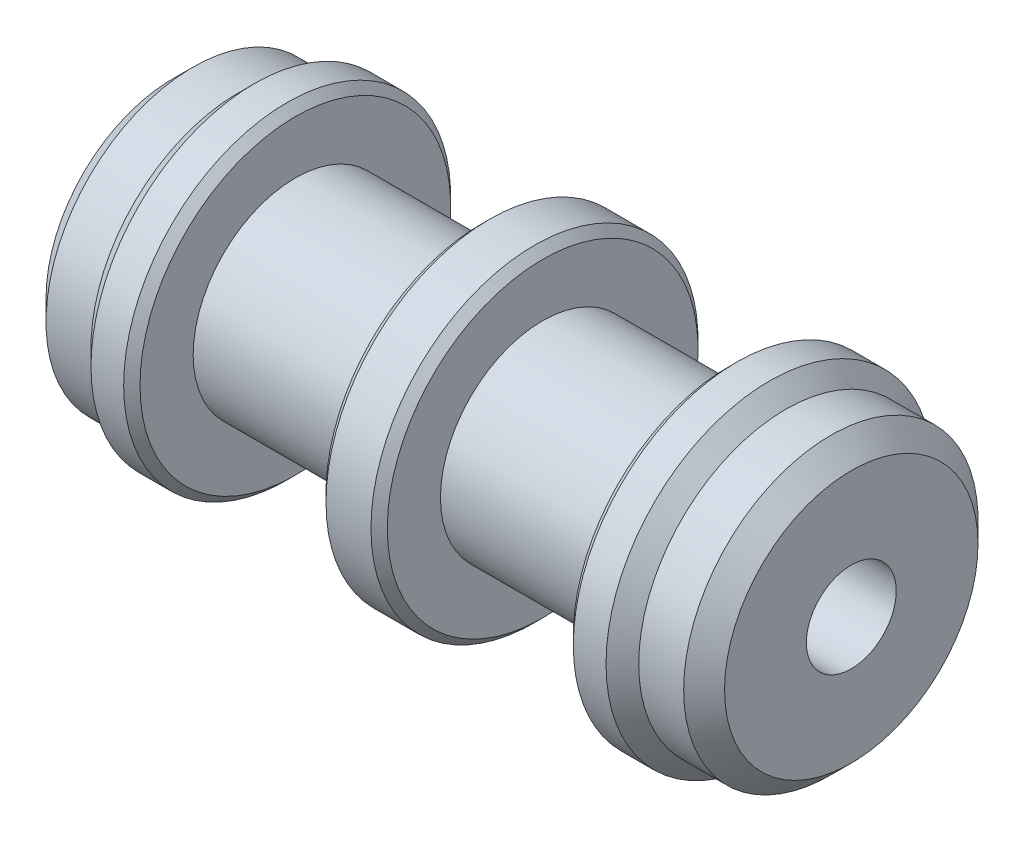
ISO-10303-21;
HEADER;
FILE_DESCRIPTION(('STEP AP214'),'2;1');
FILE_NAME('part.step','',(''),(''),'','','');
FILE_SCHEMA(('AUTOMOTIVE_DESIGN { 1 0 10303 214 1 1 1 1 }'));
ENDSEC;
DATA;
#1=APPLICATION_CONTEXT('core data for automotive mechanical design processes');
#2=APPLICATION_PROTOCOL_DEFINITION('international standard','automotive_design',2000,#1);
#3=PRODUCT_CONTEXT('',#1,'mechanical');
#4=PRODUCT('Part','Part','',(#3));
#5=PRODUCT_RELATED_PRODUCT_CATEGORY('part','',(#4));
#6=PRODUCT_DEFINITION_FORMATION('','',#4);
#7=PRODUCT_DEFINITION_CONTEXT('part definition',#1,'design');
#8=PRODUCT_DEFINITION('design','',#6,#7);
#9=PRODUCT_DEFINITION_SHAPE('','',#8);
#10=(LENGTH_UNIT() NAMED_UNIT(*) SI_UNIT(.MILLI.,.METRE.));
#11=(NAMED_UNIT(*) PLANE_ANGLE_UNIT() SI_UNIT($,.RADIAN.));
#12=(NAMED_UNIT(*) SI_UNIT($,.STERADIAN.) SOLID_ANGLE_UNIT());
#13=UNCERTAINTY_MEASURE_WITH_UNIT(LENGTH_MEASURE(1.E-05),#10,'distance_accuracy_value','');
#14=(GEOMETRIC_REPRESENTATION_CONTEXT(3) GLOBAL_UNCERTAINTY_ASSIGNED_CONTEXT((#13)) GLOBAL_UNIT_ASSIGNED_CONTEXT((#10,
#11,#12)) REPRESENTATION_CONTEXT('',''));
#15=CARTESIAN_POINT('',(0.,0.,0.));
#16=DIRECTION('',(0.,0.,1.));
#17=DIRECTION('',(1.,0.,0.));
#18=AXIS2_PLACEMENT_3D('',#15,#16,#17);
#19=CARTESIAN_POINT('',(-7.8,0.,0.));
#20=DIRECTION('',(-1.,0.,0.));
#21=DIRECTION('',(0.,0.,1.));
#22=AXIS2_PLACEMENT_3D('',#19,#20,#21);
#23=CYLINDRICAL_SURFACE('',#22,4.);
#24=CARTESIAN_POINT('',(-0.550000000032469,0.,0.));
#25=DIRECTION('',(1.,0.,0.));
#26=DIRECTION('',(0.,0.,-1.));
#27=AXIS2_PLACEMENT_3D('',#24,#25,#26);
#28=CIRCLE('',#27,3.99999999990541);
#29=CARTESIAN_POINT('',(-0.550000000032469,0.,-3.99999999990541));
#30=VERTEX_POINT('',#29);
#31=EDGE_CURVE('E62',#30,#30,#28,.F.);
#32=ORIENTED_EDGE('',*,*,#31,.F.);
#33=EDGE_LOOP('',(#32));
#34=FACE_BOUND('',#33,.T.);
#35=CARTESIAN_POINT('',(0.550000000032469,0.,0.));
#36=DIRECTION('',(-1.,0.,0.));
#37=DIRECTION('',(0.,0.,1.));
#38=AXIS2_PLACEMENT_3D('',#35,#36,#37);
#39=CIRCLE('',#38,3.99999999990541);
#40=CARTESIAN_POINT('',(0.550000000032469,0.,3.99999999990541));
#41=VERTEX_POINT('',#40);
#42=EDGE_CURVE('E30',#41,#41,#39,.F.);
#43=ORIENTED_EDGE('',*,*,#42,.F.);
#44=EDGE_LOOP('',(#43));
#45=FACE_BOUND('',#44,.T.);
#46=ADVANCED_FACE('F15',(#34,#45),#23,.T.);
#47=CARTESIAN_POINT('',(0.550000000032469,0.,0.));
#48=DIRECTION('',(-1.,0.,0.));
#49=DIRECTION('',(0.,0.,1.));
#50=AXIS2_PLACEMENT_3D('',#47,#48,#49);
#51=CONICAL_SURFACE('',#50,3.99999999990541,0.785398163397448);
#52=ORIENTED_EDGE('',*,*,#42,.T.);
#53=EDGE_LOOP('',(#52));
#54=FACE_BOUND('',#53,.T.);
#55=CARTESIAN_POINT('',(0.749999999925421,0.,0.));
#56=DIRECTION('',(-1.,0.,0.));
#57=DIRECTION('',(0.,0.,1.));
#58=AXIS2_PLACEMENT_3D('',#55,#56,#57);
#59=CIRCLE('',#58,3.80000000001246);
#60=CARTESIAN_POINT('',(0.749999999925421,0.,3.80000000001246));
#61=VERTEX_POINT('',#60);
#62=EDGE_CURVE('E18',#61,#61,#59,.F.);
#63=ORIENTED_EDGE('',*,*,#62,.F.);
#64=EDGE_LOOP('',(#63));
#65=FACE_BOUND('',#64,.T.);
#66=ADVANCED_FACE('F286',(#54,#65),#51,.T.);
#67=CARTESIAN_POINT('',(-0.550000000032469,0.,0.));
#68=DIRECTION('',(1.,0.,0.));
#69=DIRECTION('',(0.,0.,-1.));
#70=AXIS2_PLACEMENT_3D('',#67,#68,#69);
#71=CONICAL_SURFACE('',#70,3.99999999990541,0.785398163397448);
#72=ORIENTED_EDGE('',*,*,#31,.T.);
#73=EDGE_LOOP('',(#72));
#74=FACE_BOUND('',#73,.T.);
#75=CARTESIAN_POINT('',(-0.749999999925421,0.,0.));
#76=DIRECTION('',(1.,0.,0.));
#77=DIRECTION('',(0.,0.,-1.));
#78=AXIS2_PLACEMENT_3D('',#75,#76,#77);
#79=CIRCLE('',#78,3.80000000001246);
#80=CARTESIAN_POINT('',(-0.749999999925421,0.,-3.80000000001246));
#81=VERTEX_POINT('',#80);
#82=EDGE_CURVE('E57',#81,#81,#79,.T.);
#83=ORIENTED_EDGE('',*,*,#82,.T.);
#84=EDGE_LOOP('',(#83));
#85=FACE_BOUND('',#84,.T.);
#86=ADVANCED_FACE('F278',(#74,#85),#71,.T.);
#87=CARTESIAN_POINT('',(0.75,0.,0.));
#88=DIRECTION('',(1.,0.,0.));
#89=DIRECTION('',(0.,0.,-1.));
#90=AXIS2_PLACEMENT_3D('',#87,#88,#89);
#91=PLANE('',#90);
#92=ORIENTED_EDGE('',*,*,#62,.T.);
#93=EDGE_LOOP('',(#92));
#94=FACE_BOUND('',#93,.T.);
#95=CARTESIAN_POINT('',(0.750000000000001,0.,0.));
#96=DIRECTION('',(1.,0.,0.));
#97=DIRECTION('',(0.,0.,-1.));
#98=AXIS2_PLACEMENT_3D('',#95,#96,#97);
#99=CIRCLE('',#98,2.5);
#100=CARTESIAN_POINT('',(0.750000000000001,0.,-2.5));
#101=VERTEX_POINT('',#100);
#102=EDGE_CURVE('E55',#101,#101,#99,.T.);
#103=ORIENTED_EDGE('',*,*,#102,.F.);
#104=EDGE_LOOP('',(#103));
#105=FACE_BOUND('',#104,.T.);
#106=ADVANCED_FACE('F269',(#94,#105),#91,.T.);
#107=CARTESIAN_POINT('',(-0.75,0.,0.));
#108=DIRECTION('',(1.,0.,0.));
#109=DIRECTION('',(0.,0.,-1.));
#110=AXIS2_PLACEMENT_3D('',#107,#108,#109);
#111=PLANE('',#110);
#112=ORIENTED_EDGE('',*,*,#82,.F.);
#113=EDGE_LOOP('',(#112));
#114=FACE_BOUND('',#113,.T.);
#115=CARTESIAN_POINT('',(-0.750000000000001,0.,0.));
#116=DIRECTION('',(1.,0.,0.));
#117=DIRECTION('',(0.,0.,-1.));
#118=AXIS2_PLACEMENT_3D('',#115,#116,#117);
#119=CIRCLE('',#118,2.5);
#120=CARTESIAN_POINT('',(-0.750000000000001,0.,-2.5));
#121=VERTEX_POINT('',#120);
#122=EDGE_CURVE('E52',#121,#121,#119,.F.);
#123=ORIENTED_EDGE('',*,*,#122,.F.);
#124=EDGE_LOOP('',(#123));
#125=FACE_BOUND('',#124,.T.);
#126=ADVANCED_FACE('F260',(#114,#125),#111,.F.);
#127=CARTESIAN_POINT('',(-9.13,0.,0.));
#128=DIRECTION('',(1.,0.,0.));
#129=DIRECTION('',(0.,0.,-1.));
#130=AXIS2_PLACEMENT_3D('',#127,#128,#129);
#131=CYLINDRICAL_SURFACE('',#130,2.5);
#132=ORIENTED_EDGE('',*,*,#102,.T.);
#133=EDGE_LOOP('',(#132));
#134=FACE_BOUND('',#133,.T.);
#135=CARTESIAN_POINT('',(5.3,0.,0.));
#136=DIRECTION('',(1.,0.,0.));
#137=DIRECTION('',(0.,0.,-1.));
#138=AXIS2_PLACEMENT_3D('',#135,#136,#137);
#139=CIRCLE('',#138,2.5);
#140=CARTESIAN_POINT('',(5.3,0.,-2.5));
#141=VERTEX_POINT('',#140);
#142=EDGE_CURVE('E49',#141,#141,#139,.T.);
#143=ORIENTED_EDGE('',*,*,#142,.F.);
#144=EDGE_LOOP('',(#143));
#145=FACE_BOUND('',#144,.T.);
#146=ADVANCED_FACE('F251',(#134,#145),#131,.T.);
#147=CARTESIAN_POINT('',(-9.13,0.,0.));
#148=DIRECTION('',(1.,0.,0.));
#149=DIRECTION('',(0.,0.,-1.));
#150=AXIS2_PLACEMENT_3D('',#147,#148,#149);
#151=CYLINDRICAL_SURFACE('',#150,2.5);
#152=ORIENTED_EDGE('',*,*,#122,.T.);
#153=EDGE_LOOP('',(#152));
#154=FACE_BOUND('',#153,.T.);
#155=CARTESIAN_POINT('',(-5.3,0.,0.));
#156=DIRECTION('',(1.,0.,0.));
#157=DIRECTION('',(0.,0.,-1.));
#158=AXIS2_PLACEMENT_3D('',#155,#156,#157);
#159=CIRCLE('',#158,2.5);
#160=CARTESIAN_POINT('',(-5.3,0.,-2.5));
#161=VERTEX_POINT('',#160);
#162=EDGE_CURVE('E46',#161,#161,#159,.T.);
#163=ORIENTED_EDGE('',*,*,#162,.T.);
#164=EDGE_LOOP('',(#163));
#165=FACE_BOUND('',#164,.T.);
#166=ADVANCED_FACE('F242',(#154,#165),#151,.T.);
#167=CARTESIAN_POINT('',(5.3,0.,0.));
#168=DIRECTION('',(-1.,0.,0.));
#169=DIRECTION('',(0.,0.,1.));
#170=AXIS2_PLACEMENT_3D('',#167,#168,#169);
#171=PLANE('',#170);
#172=CARTESIAN_POINT('',(5.29999999992015,0.,0.));
#173=DIRECTION('',(1.,0.,0.));
#174=DIRECTION('',(0.,0.,-1.));
#175=AXIS2_PLACEMENT_3D('',#172,#173,#174);
#176=CIRCLE('',#175,3.79999999995562);
#177=CARTESIAN_POINT('',(5.29999999992015,0.,-3.79999999995562));
#178=VERTEX_POINT('',#177);
#179=EDGE_CURVE('E43',#178,#178,#176,.T.);
#180=ORIENTED_EDGE('',*,*,#179,.F.);
#181=EDGE_LOOP('',(#180));
#182=FACE_BOUND('',#181,.T.);
#183=ORIENTED_EDGE('',*,*,#142,.T.);
#184=EDGE_LOOP('',(#183));
#185=FACE_BOUND('',#184,.T.);
#186=ADVANCED_FACE('F233',(#182,#185),#171,.T.);
#187=CARTESIAN_POINT('',(-5.3,0.,0.));
#188=DIRECTION('',(-1.,0.,0.));
#189=DIRECTION('',(0.,0.,1.));
#190=AXIS2_PLACEMENT_3D('',#187,#188,#189);
#191=PLANE('',#190);
#192=CARTESIAN_POINT('',(-5.29999999992015,0.,0.));
#193=DIRECTION('',(-1.,0.,0.));
#194=DIRECTION('',(0.,0.,1.));
#195=AXIS2_PLACEMENT_3D('',#192,#193,#194);
#196=CIRCLE('',#195,3.79999999995562);
#197=CARTESIAN_POINT('',(-5.29999999992015,0.,3.79999999995562));
#198=VERTEX_POINT('',#197);
#199=EDGE_CURVE('E39',#198,#198,#196,.T.);
#200=ORIENTED_EDGE('',*,*,#199,.F.);
#201=EDGE_LOOP('',(#200));
#202=FACE_BOUND('',#201,.T.);
#203=ORIENTED_EDGE('',*,*,#162,.F.);
#204=EDGE_LOOP('',(#203));
#205=FACE_BOUND('',#204,.T.);
#206=ADVANCED_FACE('F224',(#202,#205),#191,.F.);
#207=CARTESIAN_POINT('',(5.49999999992679,0.,0.));
#208=DIRECTION('',(1.,0.,0.));
#209=DIRECTION('',(0.,0.,-1.));
#210=AXIS2_PLACEMENT_3D('',#207,#208,#209);
#211=CONICAL_SURFACE('',#210,4.0000000000191,0.785398163539557);
#212=CARTESIAN_POINT('',(5.5,0.,0.));
#213=DIRECTION('',(-1.,0.,0.));
#214=DIRECTION('',(0.,0.,1.));
#215=AXIS2_PLACEMENT_3D('',#212,#213,#214);
#216=CIRCLE('',#215,4.);
#217=CARTESIAN_POINT('',(5.5,0.,4.));
#218=VERTEX_POINT('',#217);
#219=EDGE_CURVE('E42',#218,#218,#216,.F.);
#220=ORIENTED_EDGE('',*,*,#219,.F.);
#221=EDGE_LOOP('',(#220));
#222=FACE_BOUND('',#221,.T.);
#223=ORIENTED_EDGE('',*,*,#179,.T.);
#224=EDGE_LOOP('',(#223));
#225=FACE_BOUND('',#224,.T.);
#226=ADVANCED_FACE('F215',(#222,#225),#211,.T.);
#227=CARTESIAN_POINT('',(-5.49999999992679,0.,0.));
#228=DIRECTION('',(-1.,0.,0.));
#229=DIRECTION('',(0.,0.,1.));
#230=AXIS2_PLACEMENT_3D('',#227,#228,#229);
#231=CONICAL_SURFACE('',#230,4.0000000000191,0.785398163539557);
#232=CARTESIAN_POINT('',(-5.5,0.,0.));
#233=DIRECTION('',(-1.,0.,0.));
#234=DIRECTION('',(0.,0.,1.));
#235=AXIS2_PLACEMENT_3D('',#232,#233,#234);
#236=CIRCLE('',#235,4.);
#237=CARTESIAN_POINT('',(-5.5,0.,4.));
#238=VERTEX_POINT('',#237);
#239=EDGE_CURVE('E72',#238,#238,#236,.T.);
#240=ORIENTED_EDGE('',*,*,#239,.F.);
#241=EDGE_LOOP('',(#240));
#242=FACE_BOUND('',#241,.T.);
#243=ORIENTED_EDGE('',*,*,#199,.T.);
#244=EDGE_LOOP('',(#243));
#245=FACE_BOUND('',#244,.T.);
#246=ADVANCED_FACE('F206',(#242,#245),#231,.T.);
#247=CARTESIAN_POINT('',(-7.8,0.,0.));
#248=DIRECTION('',(-1.,0.,0.));
#249=DIRECTION('',(0.,0.,1.));
#250=AXIS2_PLACEMENT_3D('',#247,#248,#249);
#251=CYLINDRICAL_SURFACE('',#250,4.);
#252=ORIENTED_EDGE('',*,*,#219,.T.);
#253=EDGE_LOOP('',(#252));
#254=FACE_BOUND('',#253,.T.);
#255=CARTESIAN_POINT('',(6.30000000001019,0.,0.));
#256=DIRECTION('',(-1.,0.,0.));
#257=DIRECTION('',(0.,0.,1.));
#258=AXIS2_PLACEMENT_3D('',#255,#256,#257);
#259=CIRCLE('',#258,4.00000000007594);
#260=CARTESIAN_POINT('',(6.30000000001019,0.,4.00000000007594));
#261=VERTEX_POINT('',#260);
#262=EDGE_CURVE('E75',#261,#261,#259,.F.);
#263=ORIENTED_EDGE('',*,*,#262,.F.);
#264=EDGE_LOOP('',(#263));
#265=FACE_BOUND('',#264,.T.);
#266=ADVANCED_FACE('F197',(#254,#265),#251,.T.);
#267=CARTESIAN_POINT('',(-7.8,0.,0.));
#268=DIRECTION('',(-1.,0.,0.));
#269=DIRECTION('',(0.,0.,1.));
#270=AXIS2_PLACEMENT_3D('',#267,#268,#269);
#271=CYLINDRICAL_SURFACE('',#270,4.);
#272=CARTESIAN_POINT('',(-6.30000000001019,0.,0.));
#273=DIRECTION('',(1.,0.,0.));
#274=DIRECTION('',(0.,0.,-1.));
#275=AXIS2_PLACEMENT_3D('',#272,#273,#274);
#276=CIRCLE('',#275,4.00000000007594);
#277=CARTESIAN_POINT('',(-6.30000000001019,0.,-4.00000000007594));
#278=VERTEX_POINT('',#277);
#279=EDGE_CURVE('E78',#278,#278,#276,.F.);
#280=ORIENTED_EDGE('',*,*,#279,.F.);
#281=EDGE_LOOP('',(#280));
#282=FACE_BOUND('',#281,.T.);
#283=ORIENTED_EDGE('',*,*,#239,.T.);
#284=EDGE_LOOP('',(#283));
#285=FACE_BOUND('',#284,.T.);
#286=ADVANCED_FACE('F188',(#282,#285),#271,.T.);
#287=CARTESIAN_POINT('',(6.30000000012387,0.,0.));
#288=DIRECTION('',(-1.,0.,0.));
#289=DIRECTION('',(0.,0.,1.));
#290=AXIS2_PLACEMENT_3D('',#287,#288,#289);
#291=CONICAL_SURFACE('',#290,3.99999999996226,0.785398163397448);
#292=ORIENTED_EDGE('',*,*,#262,.T.);
#293=EDGE_LOOP('',(#292));
#294=FACE_BOUND('',#293,.T.);
#295=CARTESIAN_POINT('',(6.7,0.,0.));
#296=DIRECTION('',(1.,0.,0.));
#297=DIRECTION('',(0.,0.,-1.));
#298=AXIS2_PLACEMENT_3D('',#295,#296,#297);
#299=CIRCLE('',#298,3.6);
#300=CARTESIAN_POINT('',(6.7,0.,-3.6));
#301=VERTEX_POINT('',#300);
#302=EDGE_CURVE('E81',#301,#301,#299,.T.);
#303=ORIENTED_EDGE('',*,*,#302,.F.);
#304=EDGE_LOOP('',(#303));
#305=FACE_BOUND('',#304,.T.);
#306=ADVANCED_FACE('F179',(#294,#305),#291,.T.);
#307=CARTESIAN_POINT('',(-6.30000000012387,0.,0.));
#308=DIRECTION('',(1.,0.,0.));
#309=DIRECTION('',(0.,0.,-1.));
#310=AXIS2_PLACEMENT_3D('',#307,#308,#309);
#311=CONICAL_SURFACE('',#310,3.99999999996226,0.785398163397448);
#312=ORIENTED_EDGE('',*,*,#279,.T.);
#313=EDGE_LOOP('',(#312));
#314=FACE_BOUND('',#313,.T.);
#315=CARTESIAN_POINT('',(-6.7,0.,0.));
#316=DIRECTION('',(1.,0.,0.));
#317=DIRECTION('',(0.,0.,-1.));
#318=AXIS2_PLACEMENT_3D('',#315,#316,#317);
#319=CIRCLE('',#318,3.6);
#320=CARTESIAN_POINT('',(-6.7,0.,-3.6));
#321=VERTEX_POINT('',#320);
#322=EDGE_CURVE('E84',#321,#321,#319,.F.);
#323=ORIENTED_EDGE('',*,*,#322,.F.);
#324=EDGE_LOOP('',(#323));
#325=FACE_BOUND('',#324,.T.);
#326=ADVANCED_FACE('F109',(#314,#325),#311,.T.);
#327=CARTESIAN_POINT('',(7.8,0.,0.));
#328=DIRECTION('',(1.,0.,0.));
#329=DIRECTION('',(0.,0.,-1.));
#330=AXIS2_PLACEMENT_3D('',#327,#328,#329);
#331=CYLINDRICAL_SURFACE('',#330,3.6);
#332=CARTESIAN_POINT('',(7.79999999991787,0.,0.));
#333=DIRECTION('',(-1.,0.,0.));
#334=DIRECTION('',(0.,0.,1.));
#335=AXIS2_PLACEMENT_3D('',#332,#333,#334);
#336=CIRCLE('',#335,3.60000000000582);
#337=CARTESIAN_POINT('',(7.79999999991787,0.,3.60000000000582));
#338=VERTEX_POINT('',#337);
#339=EDGE_CURVE('E87',#338,#338,#336,.F.);
#340=ORIENTED_EDGE('',*,*,#339,.F.);
#341=EDGE_LOOP('',(#340));
#342=FACE_BOUND('',#341,.T.);
#343=ORIENTED_EDGE('',*,*,#302,.T.);
#344=EDGE_LOOP('',(#343));
#345=FACE_BOUND('',#344,.T.);
#346=ADVANCED_FACE('F99',(#342,#345),#331,.T.);
#347=CARTESIAN_POINT('',(-7.8,0.,0.));
#348=DIRECTION('',(1.,0.,0.));
#349=DIRECTION('',(0.,0.,-1.));
#350=AXIS2_PLACEMENT_3D('',#347,#348,#349);
#351=CYLINDRICAL_SURFACE('',#350,3.6);
#352=ORIENTED_EDGE('',*,*,#322,.T.);
#353=EDGE_LOOP('',(#352));
#354=FACE_BOUND('',#353,.T.);
#355=CARTESIAN_POINT('',(-7.79999999991787,0.,0.));
#356=DIRECTION('',(1.,0.,0.));
#357=DIRECTION('',(0.,0.,-1.));
#358=AXIS2_PLACEMENT_3D('',#355,#356,#357);
#359=CIRCLE('',#358,3.60000000000582);
#360=CARTESIAN_POINT('',(-7.79999999991787,0.,-3.60000000000582));
#361=VERTEX_POINT('',#360);
#362=EDGE_CURVE('E38',#361,#361,#359,.F.);
#363=ORIENTED_EDGE('',*,*,#362,.F.);
#364=EDGE_LOOP('',(#363));
#365=FACE_BOUND('',#364,.T.);
#366=ADVANCED_FACE('F96',(#354,#365),#351,.T.);
#367=CARTESIAN_POINT('',(7.79999999991787,0.,0.));
#368=DIRECTION('',(-1.,0.,0.));
#369=DIRECTION('',(0.,0.,1.));
#370=AXIS2_PLACEMENT_3D('',#367,#368,#369);
#371=CONICAL_SURFACE('',#370,3.60000000000582,0.785398163397448);
#372=ORIENTED_EDGE('',*,*,#339,.T.);
#373=EDGE_LOOP('',(#372));
#374=FACE_BOUND('',#373,.T.);
#375=CARTESIAN_POINT('',(8.29999999996289,0.,0.));
#376=DIRECTION('',(-1.,0.,0.));
#377=DIRECTION('',(0.,0.,1.));
#378=AXIS2_PLACEMENT_3D('',#375,#376,#377);
#379=CIRCLE('',#378,3.0999999999608);
#380=CARTESIAN_POINT('',(8.29999999996289,0.,3.0999999999608));
#381=VERTEX_POINT('',#380);
#382=EDGE_CURVE('E35',#381,#381,#379,.F.);
#383=ORIENTED_EDGE('',*,*,#382,.F.);
#384=EDGE_LOOP('',(#383));
#385=FACE_BOUND('',#384,.T.);
#386=ADVANCED_FACE('F98',(#374,#385),#371,.T.);
#387=CARTESIAN_POINT('',(-7.79999999991787,0.,0.));
#388=DIRECTION('',(1.,0.,0.));
#389=DIRECTION('',(0.,0.,-1.));
#390=AXIS2_PLACEMENT_3D('',#387,#388,#389);
#391=CONICAL_SURFACE('',#390,3.60000000000582,0.785398163397448);
#392=ORIENTED_EDGE('',*,*,#362,.T.);
#393=EDGE_LOOP('',(#392));
#394=FACE_BOUND('',#393,.T.);
#395=CARTESIAN_POINT('',(-8.29999999996289,0.,0.));
#396=DIRECTION('',(1.,0.,0.));
#397=DIRECTION('',(0.,0.,-1.));
#398=AXIS2_PLACEMENT_3D('',#395,#396,#397);
#399=CIRCLE('',#398,3.0999999999608);
#400=CARTESIAN_POINT('',(-8.29999999996289,0.,-3.0999999999608));
#401=VERTEX_POINT('',#400);
#402=EDGE_CURVE('E27',#401,#401,#399,.T.);
#403=ORIENTED_EDGE('',*,*,#402,.T.);
#404=EDGE_LOOP('',(#403));
#405=FACE_BOUND('',#404,.T.);
#406=ADVANCED_FACE('F93',(#394,#405),#391,.T.);
#407=CARTESIAN_POINT('',(8.3,0.,0.));
#408=DIRECTION('',(1.,0.,0.));
#409=DIRECTION('',(0.,0.,-1.));
#410=AXIS2_PLACEMENT_3D('',#407,#408,#409);
#411=PLANE('',#410);
#412=ORIENTED_EDGE('',*,*,#382,.T.);
#413=EDGE_LOOP('',(#412));
#414=FACE_BOUND('',#413,.T.);
#415=CARTESIAN_POINT('',(8.3,0.,0.));
#416=DIRECTION('',(1.,0.,0.));
#417=DIRECTION('',(0.,0.,-1.));
#418=AXIS2_PLACEMENT_3D('',#415,#416,#417);
#419=CIRCLE('',#418,1.1);
#420=CARTESIAN_POINT('',(8.3,0.,-1.1));
#421=VERTEX_POINT('',#420);
#422=EDGE_CURVE('E22',#421,#421,#419,.F.);
#423=ORIENTED_EDGE('',*,*,#422,.T.);
#424=EDGE_LOOP('',(#423));
#425=FACE_BOUND('',#424,.T.);
#426=ADVANCED_FACE('F120',(#414,#425),#411,.T.);
#427=CARTESIAN_POINT('',(-8.3,0.,0.));
#428=DIRECTION('',(1.,0.,0.));
#429=DIRECTION('',(0.,0.,-1.));
#430=AXIS2_PLACEMENT_3D('',#427,#428,#429);
#431=PLANE('',#430);
#432=ORIENTED_EDGE('',*,*,#402,.F.);
#433=EDGE_LOOP('',(#432));
#434=FACE_BOUND('',#433,.T.);
#435=CARTESIAN_POINT('',(-8.3,0.,0.));
#436=DIRECTION('',(1.,0.,0.));
#437=DIRECTION('',(0.,0.,-1.));
#438=AXIS2_PLACEMENT_3D('',#435,#436,#437);
#439=CIRCLE('',#438,1.1);
#440=CARTESIAN_POINT('',(-8.3,0.,-1.1));
#441=VERTEX_POINT('',#440);
#442=EDGE_CURVE('E10',#441,#441,#439,.T.);
#443=ORIENTED_EDGE('',*,*,#442,.T.);
#444=EDGE_LOOP('',(#443));
#445=FACE_BOUND('',#444,.T.);
#446=ADVANCED_FACE('F114',(#434,#445),#431,.F.);
#447=CARTESIAN_POINT('',(8.3,0.,0.));
#448=DIRECTION('',(1.,0.,0.));
#449=DIRECTION('',(0.,0.,-1.));
#450=AXIS2_PLACEMENT_3D('',#447,#448,#449);
#451=CYLINDRICAL_SURFACE('',#450,1.1);
#452=ORIENTED_EDGE('',*,*,#442,.F.);
#453=EDGE_LOOP('',(#452));
#454=FACE_BOUND('',#453,.T.);
#455=ORIENTED_EDGE('',*,*,#422,.F.);
#456=EDGE_LOOP('',(#455));
#457=FACE_BOUND('',#456,.T.);
#458=ADVANCED_FACE('F112',(#454,#457),#451,.F.);
#459=CLOSED_SHELL('',(#46,#66,#86,#106,#126,#146,#166,#186,#206,#226,#246,#266,#286,#306,#326,
#346,#366,#386,#406,#426,#446,#458));
#460=MANIFOLD_SOLID_BREP('B1',#459);
#461=ADVANCED_BREP_SHAPE_REPRESENTATION('',(#18,#460),#14);
#462=SHAPE_DEFINITION_REPRESENTATION(#9,#461);
ENDSEC;
END-ISO-10303-21;
